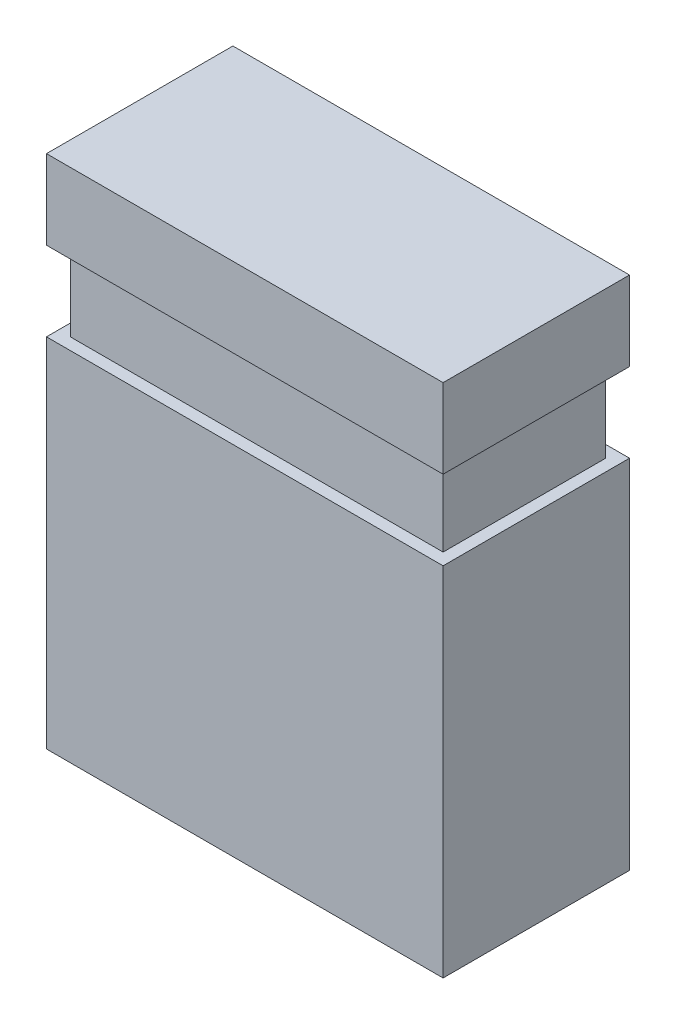
ISO-10303-21;
HEADER;
FILE_DESCRIPTION(('STEP AP214'),'2;1');
FILE_NAME('part.step','',(''),(''),'','','');
FILE_SCHEMA(('AUTOMOTIVE_DESIGN { 1 0 10303 214 1 1 1 1 }'));
ENDSEC;
DATA;
#1=APPLICATION_CONTEXT('core data for automotive mechanical design processes');
#2=APPLICATION_PROTOCOL_DEFINITION('international standard','automotive_design',2000,#1);
#3=PRODUCT_CONTEXT('',#1,'mechanical');
#4=PRODUCT('Part','Part','',(#3));
#5=PRODUCT_RELATED_PRODUCT_CATEGORY('part','',(#4));
#6=PRODUCT_DEFINITION_FORMATION('','',#4);
#7=PRODUCT_DEFINITION_CONTEXT('part definition',#1,'design');
#8=PRODUCT_DEFINITION('design','',#6,#7);
#9=PRODUCT_DEFINITION_SHAPE('','',#8);
#10=(LENGTH_UNIT() NAMED_UNIT(*) SI_UNIT(.MILLI.,.METRE.));
#11=(NAMED_UNIT(*) PLANE_ANGLE_UNIT() SI_UNIT($,.RADIAN.));
#12=(NAMED_UNIT(*) SI_UNIT($,.STERADIAN.) SOLID_ANGLE_UNIT());
#13=UNCERTAINTY_MEASURE_WITH_UNIT(LENGTH_MEASURE(1.E-05),#10,'distance_accuracy_value','');
#14=(GEOMETRIC_REPRESENTATION_CONTEXT(3) GLOBAL_UNCERTAINTY_ASSIGNED_CONTEXT((#13)) GLOBAL_UNIT_ASSIGNED_CONTEXT((#10,
#11,#12)) REPRESENTATION_CONTEXT('',''));
#15=CARTESIAN_POINT('',(0.,0.,0.));
#16=DIRECTION('',(0.,0.,1.));
#17=DIRECTION('',(1.,0.,0.));
#18=AXIS2_PLACEMENT_3D('',#15,#16,#17);
#19=CARTESIAN_POINT('',(-2.5,3.25,-1.175));
#20=DIRECTION('',(-1.,0.,0.));
#21=DIRECTION('',(0.,0.,1.));
#22=AXIS2_PLACEMENT_3D('',#19,#20,#21);
#23=PLANE('',#22);
#24=DIRECTION('',(0.,-1.,0.));
#25=VECTOR('',#24,1.);
#26=CARTESIAN_POINT('',(-2.5,3.25,1.175));
#27=LINE('',#26,#25);
#28=CARTESIAN_POINT('',(-2.5,1.25,1.175));
#29=VERTEX_POINT('',#28);
#30=CARTESIAN_POINT('',(-2.5,-3.25,1.175));
#31=VERTEX_POINT('',#30);
#32=EDGE_CURVE('E231',#29,#31,#27,.T.);
#33=ORIENTED_EDGE('',*,*,#32,.F.);
#34=DIRECTION('',(0.,0.,-1.));
#35=VECTOR('',#34,1.);
#36=CARTESIAN_POINT('',(-2.5,1.25,-1.175));
#37=LINE('',#36,#35);
#38=CARTESIAN_POINT('',(-2.5,1.25,-1.175));
#39=VERTEX_POINT('',#38);
#40=EDGE_CURVE('E226',#29,#39,#37,.T.);
#41=ORIENTED_EDGE('',*,*,#40,.T.);
#42=DIRECTION('',(0.,-1.,0.));
#43=VECTOR('',#42,1.);
#44=CARTESIAN_POINT('',(-2.5,3.25,-1.175));
#45=LINE('',#44,#43);
#46=CARTESIAN_POINT('',(-2.5,-3.25,-1.175));
#47=VERTEX_POINT('',#46);
#48=EDGE_CURVE('E245',#39,#47,#45,.T.);
#49=ORIENTED_EDGE('',*,*,#48,.T.);
#50=DIRECTION('',(0.,0.,1.));
#51=VECTOR('',#50,1.);
#52=CARTESIAN_POINT('',(-2.5,-3.25,-1.175));
#53=LINE('',#52,#51);
#54=EDGE_CURVE('E259',#47,#31,#53,.T.);
#55=ORIENTED_EDGE('',*,*,#54,.T.);
#56=EDGE_LOOP('',(#33,#41,#49,#55));
#57=FACE_BOUND('',#56,.T.);
#58=ADVANCED_FACE('F34',(#57),#23,.T.);
#59=CARTESIAN_POINT('',(2.5,3.25,-1.175));
#60=DIRECTION('',(1.,0.,0.));
#61=DIRECTION('',(0.,0.,-1.));
#62=AXIS2_PLACEMENT_3D('',#59,#60,#61);
#63=PLANE('',#62);
#64=DIRECTION('',(0.,1.,0.));
#65=VECTOR('',#64,1.);
#66=CARTESIAN_POINT('',(2.5,3.25,-1.175));
#67=LINE('',#66,#65);
#68=CARTESIAN_POINT('',(2.5,-3.25,-1.175));
#69=VERTEX_POINT('',#68);
#70=CARTESIAN_POINT('',(2.5,1.25,-1.175));
#71=VERTEX_POINT('',#70);
#72=EDGE_CURVE('E253',#69,#71,#67,.T.);
#73=ORIENTED_EDGE('',*,*,#72,.T.);
#74=DIRECTION('',(0.,0.,1.));
#75=VECTOR('',#74,1.);
#76=CARTESIAN_POINT('',(2.5,1.25,-1.175));
#77=LINE('',#76,#75);
#78=CARTESIAN_POINT('',(2.5,1.25,1.175));
#79=VERTEX_POINT('',#78);
#80=EDGE_CURVE('E223',#71,#79,#77,.T.);
#81=ORIENTED_EDGE('',*,*,#80,.T.);
#82=DIRECTION('',(0.,1.,0.));
#83=VECTOR('',#82,1.);
#84=CARTESIAN_POINT('',(2.5,3.25,1.175));
#85=LINE('',#84,#83);
#86=CARTESIAN_POINT('',(2.5,-3.25,1.175));
#87=VERTEX_POINT('',#86);
#88=EDGE_CURVE('E239',#87,#79,#85,.T.);
#89=ORIENTED_EDGE('',*,*,#88,.F.);
#90=DIRECTION('',(0.,0.,1.));
#91=VECTOR('',#90,1.);
#92=CARTESIAN_POINT('',(2.5,-3.25,-1.175));
#93=LINE('',#92,#91);
#94=EDGE_CURVE('E265',#69,#87,#93,.T.);
#95=ORIENTED_EDGE('',*,*,#94,.F.);
#96=EDGE_LOOP('',(#73,#81,#89,#95));
#97=FACE_BOUND('',#96,.T.);
#98=ADVANCED_FACE('F288',(#97),#63,.T.);
#99=CARTESIAN_POINT('',(-2.5,-3.25,-1.175));
#100=DIRECTION('',(0.,0.,1.));
#101=DIRECTION('',(1.,0.,0.));
#102=AXIS2_PLACEMENT_3D('',#99,#100,#101);
#103=PLANE('',#102);
#104=DIRECTION('',(-1.,0.,0.));
#105=VECTOR('',#104,1.);
#106=CARTESIAN_POINT('',(-2.5,1.25,-1.175));
#107=LINE('',#106,#105);
#108=EDGE_CURVE('E229',#71,#39,#107,.T.);
#109=ORIENTED_EDGE('',*,*,#108,.F.);
#110=ORIENTED_EDGE('',*,*,#72,.F.);
#111=DIRECTION('',(1.,0.,0.));
#112=VECTOR('',#111,1.);
#113=CARTESIAN_POINT('',(-2.5,-3.25,-1.175));
#114=LINE('',#113,#112);
#115=EDGE_CURVE('E249',#47,#69,#114,.T.);
#116=ORIENTED_EDGE('',*,*,#115,.F.);
#117=ORIENTED_EDGE('',*,*,#48,.F.);
#118=EDGE_LOOP('',(#109,#110,#116,#117));
#119=FACE_BOUND('',#118,.T.);
#120=ADVANCED_FACE('F294',(#119),#103,.F.);
#121=CARTESIAN_POINT('',(-2.5,-3.25,1.175));
#122=DIRECTION('',(0.,0.,1.));
#123=DIRECTION('',(1.,0.,0.));
#124=AXIS2_PLACEMENT_3D('',#121,#122,#123);
#125=PLANE('',#124);
#126=ORIENTED_EDGE('',*,*,#88,.T.);
#127=DIRECTION('',(-1.,0.,0.));
#128=VECTOR('',#127,1.);
#129=CARTESIAN_POINT('',(-2.5,1.25,1.175));
#130=LINE('',#129,#128);
#131=EDGE_CURVE('E12',#79,#29,#130,.T.);
#132=ORIENTED_EDGE('',*,*,#131,.T.);
#133=ORIENTED_EDGE('',*,*,#32,.T.);
#134=DIRECTION('',(1.,0.,0.));
#135=VECTOR('',#134,1.);
#136=CARTESIAN_POINT('',(-2.5,-3.25,1.175));
#137=LINE('',#136,#135);
#138=EDGE_CURVE('E235',#31,#87,#137,.T.);
#139=ORIENTED_EDGE('',*,*,#138,.T.);
#140=EDGE_LOOP('',(#126,#132,#133,#139));
#141=FACE_BOUND('',#140,.T.);
#142=ADVANCED_FACE('F307',(#141),#125,.T.);
#143=CARTESIAN_POINT('',(-2.5,-3.25,-1.175));
#144=DIRECTION('',(0.,-1.,0.));
#145=DIRECTION('',(0.,0.,-1.));
#146=AXIS2_PLACEMENT_3D('',#143,#144,#145);
#147=PLANE('',#146);
#148=DIRECTION('',(0.,0.,-1.));
#149=VECTOR('',#148,1.);
#150=CARTESIAN_POINT('',(-2.,-3.25,0.675));
#151=LINE('',#150,#149);
#152=CARTESIAN_POINT('',(-2.,-3.25,0.675));
#153=VERTEX_POINT('',#152);
#154=CARTESIAN_POINT('',(-2.,-3.25,-0.675));
#155=VERTEX_POINT('',#154);
#156=EDGE_CURVE('E49',#153,#155,#151,.T.);
#157=ORIENTED_EDGE('',*,*,#156,.F.);
#158=DIRECTION('',(-1.,0.,0.));
#159=VECTOR('',#158,1.);
#160=CARTESIAN_POINT('',(-2.,-3.25,0.675));
#161=LINE('',#160,#159);
#162=CARTESIAN_POINT('',(2.,-3.25,0.675));
#163=VERTEX_POINT('',#162);
#164=EDGE_CURVE('E167',#163,#153,#161,.T.);
#165=ORIENTED_EDGE('',*,*,#164,.F.);
#166=DIRECTION('',(0.,0.,1.));
#167=VECTOR('',#166,1.);
#168=CARTESIAN_POINT('',(2.,-3.25,0.675));
#169=LINE('',#168,#167);
#170=CARTESIAN_POINT('',(2.,-3.25,-0.675));
#171=VERTEX_POINT('',#170);
#172=EDGE_CURVE('E170',#171,#163,#169,.T.);
#173=ORIENTED_EDGE('',*,*,#172,.F.);
#174=DIRECTION('',(1.,0.,0.));
#175=VECTOR('',#174,1.);
#176=CARTESIAN_POINT('',(-2.,-3.25,-0.675));
#177=LINE('',#176,#175);
#178=EDGE_CURVE('E176',#155,#171,#177,.T.);
#179=ORIENTED_EDGE('',*,*,#178,.F.);
#180=EDGE_LOOP('',(#157,#165,#173,#179));
#181=FACE_BOUND('',#180,.T.);
#182=ORIENTED_EDGE('',*,*,#94,.T.);
#183=ORIENTED_EDGE('',*,*,#138,.F.);
#184=ORIENTED_EDGE('',*,*,#54,.F.);
#185=ORIENTED_EDGE('',*,*,#115,.T.);
#186=EDGE_LOOP('',(#182,#183,#184,#185));
#187=FACE_BOUND('',#186,.T.);
#188=ADVANCED_FACE('F316',(#181,#187),#147,.T.);
#189=CARTESIAN_POINT('',(0.,1.25,0.));
#190=DIRECTION('',(0.,1.,0.));
#191=DIRECTION('',(0.,0.,1.));
#192=AXIS2_PLACEMENT_3D('',#189,#190,#191);
#193=PLANE('',#192);
#194=DIRECTION('',(-1.,0.,0.));
#195=VECTOR('',#194,1.);
#196=CARTESIAN_POINT('',(-2.35,1.25,-1.025));
#197=LINE('',#196,#195);
#198=CARTESIAN_POINT('',(2.35,1.25,-1.025));
#199=VERTEX_POINT('',#198);
#200=CARTESIAN_POINT('',(-2.35,1.25,-1.025));
#201=VERTEX_POINT('',#200);
#202=EDGE_CURVE('E196',#199,#201,#197,.T.);
#203=ORIENTED_EDGE('',*,*,#202,.F.);
#204=DIRECTION('',(0.,0.,-1.));
#205=VECTOR('',#204,1.);
#206=CARTESIAN_POINT('',(2.35,1.25,-1.025));
#207=LINE('',#206,#205);
#208=CARTESIAN_POINT('',(2.35,1.25,1.025));
#209=VERTEX_POINT('',#208);
#210=EDGE_CURVE('E193',#209,#199,#207,.T.);
#211=ORIENTED_EDGE('',*,*,#210,.F.);
#212=DIRECTION('',(1.,0.,0.));
#213=VECTOR('',#212,1.);
#214=CARTESIAN_POINT('',(-2.35,1.25,1.025));
#215=LINE('',#214,#213);
#216=CARTESIAN_POINT('',(-2.35,1.25,1.025));
#217=VERTEX_POINT('',#216);
#218=EDGE_CURVE('E189',#217,#209,#215,.T.);
#219=ORIENTED_EDGE('',*,*,#218,.F.);
#220=DIRECTION('',(0.,0.,1.));
#221=VECTOR('',#220,1.);
#222=CARTESIAN_POINT('',(-2.35,1.25,-1.025));
#223=LINE('',#222,#221);
#224=EDGE_CURVE('E186',#201,#217,#223,.T.);
#225=ORIENTED_EDGE('',*,*,#224,.F.);
#226=EDGE_LOOP('',(#203,#211,#219,#225));
#227=FACE_BOUND('',#226,.T.);
#228=ORIENTED_EDGE('',*,*,#108,.T.);
#229=ORIENTED_EDGE('',*,*,#40,.F.);
#230=ORIENTED_EDGE('',*,*,#131,.F.);
#231=ORIENTED_EDGE('',*,*,#80,.F.);
#232=EDGE_LOOP('',(#228,#229,#230,#231));
#233=FACE_BOUND('',#232,.T.);
#234=ADVANCED_FACE('F310',(#227,#233),#193,.T.);
#235=CARTESIAN_POINT('',(0.,2.25,0.));
#236=DIRECTION('',(0.,1.,0.));
#237=DIRECTION('',(0.,0.,1.));
#238=AXIS2_PLACEMENT_3D('',#235,#236,#237);
#239=PLANE('',#238);
#240=DIRECTION('',(0.,0.,1.));
#241=VECTOR('',#240,1.);
#242=CARTESIAN_POINT('',(-2.35,2.25,-1.025));
#243=LINE('',#242,#241);
#244=CARTESIAN_POINT('',(-2.35,2.25,-1.025));
#245=VERTEX_POINT('',#244);
#246=CARTESIAN_POINT('',(-2.35,2.25,1.025));
#247=VERTEX_POINT('',#246);
#248=EDGE_CURVE('E182',#245,#247,#243,.T.);
#249=ORIENTED_EDGE('',*,*,#248,.T.);
#250=DIRECTION('',(1.,0.,0.));
#251=VECTOR('',#250,1.);
#252=CARTESIAN_POINT('',(-2.35,2.25,1.025));
#253=LINE('',#252,#251);
#254=CARTESIAN_POINT('',(2.35,2.25,1.025));
#255=VERTEX_POINT('',#254);
#256=EDGE_CURVE('E201',#247,#255,#253,.T.);
#257=ORIENTED_EDGE('',*,*,#256,.T.);
#258=DIRECTION('',(0.,0.,-1.));
#259=VECTOR('',#258,1.);
#260=CARTESIAN_POINT('',(2.35,2.25,-1.025));
#261=LINE('',#260,#259);
#262=CARTESIAN_POINT('',(2.35,2.25,-1.025));
#263=VERTEX_POINT('',#262);
#264=EDGE_CURVE('E204',#255,#263,#261,.T.);
#265=ORIENTED_EDGE('',*,*,#264,.T.);
#266=DIRECTION('',(-1.,0.,0.));
#267=VECTOR('',#266,1.);
#268=CARTESIAN_POINT('',(-2.35,2.25,-1.025));
#269=LINE('',#268,#267);
#270=EDGE_CURVE('E190',#263,#245,#269,.T.);
#271=ORIENTED_EDGE('',*,*,#270,.T.);
#272=EDGE_LOOP('',(#249,#257,#265,#271));
#273=FACE_BOUND('',#272,.T.);
#274=DIRECTION('',(0.,0.,1.));
#275=VECTOR('',#274,1.);
#276=CARTESIAN_POINT('',(2.5,2.25,-1.175));
#277=LINE('',#276,#275);
#278=CARTESIAN_POINT('',(2.5,2.25,-1.175));
#279=VERTEX_POINT('',#278);
#280=CARTESIAN_POINT('',(2.5,2.25,1.175));
#281=VERTEX_POINT('',#280);
#282=EDGE_CURVE('E57',#279,#281,#277,.T.);
#283=ORIENTED_EDGE('',*,*,#282,.T.);
#284=DIRECTION('',(-1.,0.,0.));
#285=VECTOR('',#284,1.);
#286=CARTESIAN_POINT('',(-2.5,2.25,1.175));
#287=LINE('',#286,#285);
#288=CARTESIAN_POINT('',(-2.5,2.25,1.175));
#289=VERTEX_POINT('',#288);
#290=EDGE_CURVE('E42',#281,#289,#287,.T.);
#291=ORIENTED_EDGE('',*,*,#290,.T.);
#292=DIRECTION('',(0.,0.,-1.));
#293=VECTOR('',#292,1.);
#294=CARTESIAN_POINT('',(-2.5,2.25,-1.175));
#295=LINE('',#294,#293);
#296=CARTESIAN_POINT('',(-2.5,2.25,-1.175));
#297=VERTEX_POINT('',#296);
#298=EDGE_CURVE('E218',#289,#297,#295,.T.);
#299=ORIENTED_EDGE('',*,*,#298,.T.);
#300=DIRECTION('',(-1.,0.,0.));
#301=VECTOR('',#300,1.);
#302=CARTESIAN_POINT('',(-2.5,2.25,-1.175));
#303=LINE('',#302,#301);
#304=EDGE_CURVE('E220',#279,#297,#303,.T.);
#305=ORIENTED_EDGE('',*,*,#304,.F.);
#306=EDGE_LOOP('',(#283,#291,#299,#305));
#307=FACE_BOUND('',#306,.T.);
#308=ADVANCED_FACE('F269',(#273,#307),#239,.F.);
#309=CARTESIAN_POINT('',(-2.35,1.25,-1.025));
#310=DIRECTION('',(-1.,0.,0.));
#311=DIRECTION('',(0.,0.,1.));
#312=AXIS2_PLACEMENT_3D('',#309,#310,#311);
#313=PLANE('',#312);
#314=ORIENTED_EDGE('',*,*,#248,.F.);
#315=DIRECTION('',(0.,1.,0.));
#316=VECTOR('',#315,1.);
#317=CARTESIAN_POINT('',(-2.35,1.25,-1.025));
#318=LINE('',#317,#316);
#319=EDGE_CURVE('E209',#201,#245,#318,.T.);
#320=ORIENTED_EDGE('',*,*,#319,.F.);
#321=ORIENTED_EDGE('',*,*,#224,.T.);
#322=DIRECTION('',(0.,1.,0.));
#323=VECTOR('',#322,1.);
#324=CARTESIAN_POINT('',(-2.35,1.25,1.025));
#325=LINE('',#324,#323);
#326=EDGE_CURVE('E199',#217,#247,#325,.T.);
#327=ORIENTED_EDGE('',*,*,#326,.T.);
#328=EDGE_LOOP('',(#314,#320,#321,#327));
#329=FACE_BOUND('',#328,.T.);
#330=ADVANCED_FACE('F348',(#329),#313,.T.);
#331=CARTESIAN_POINT('',(-2.35,1.25,-1.025));
#332=DIRECTION('',(0.,0.,-1.));
#333=DIRECTION('',(-1.,0.,0.));
#334=AXIS2_PLACEMENT_3D('',#331,#332,#333);
#335=PLANE('',#334);
#336=ORIENTED_EDGE('',*,*,#270,.F.);
#337=DIRECTION('',(0.,1.,0.));
#338=VECTOR('',#337,1.);
#339=CARTESIAN_POINT('',(2.35,1.25,-1.025));
#340=LINE('',#339,#338);
#341=EDGE_CURVE('E211',#199,#263,#340,.T.);
#342=ORIENTED_EDGE('',*,*,#341,.F.);
#343=ORIENTED_EDGE('',*,*,#202,.T.);
#344=ORIENTED_EDGE('',*,*,#319,.T.);
#345=EDGE_LOOP('',(#336,#342,#343,#344));
#346=FACE_BOUND('',#345,.T.);
#347=ADVANCED_FACE('F344',(#346),#335,.T.);
#348=CARTESIAN_POINT('',(2.35,1.25,-1.025));
#349=DIRECTION('',(1.,0.,0.));
#350=DIRECTION('',(0.,0.,-1.));
#351=AXIS2_PLACEMENT_3D('',#348,#349,#350);
#352=PLANE('',#351);
#353=ORIENTED_EDGE('',*,*,#264,.F.);
#354=DIRECTION('',(0.,1.,0.));
#355=VECTOR('',#354,1.);
#356=CARTESIAN_POINT('',(2.35,1.25,1.025));
#357=LINE('',#356,#355);
#358=EDGE_CURVE('E213',#209,#255,#357,.T.);
#359=ORIENTED_EDGE('',*,*,#358,.F.);
#360=ORIENTED_EDGE('',*,*,#210,.T.);
#361=ORIENTED_EDGE('',*,*,#341,.T.);
#362=EDGE_LOOP('',(#353,#359,#360,#361));
#363=FACE_BOUND('',#362,.T.);
#364=ADVANCED_FACE('F347',(#363),#352,.T.);
#365=CARTESIAN_POINT('',(-2.35,1.25,1.025));
#366=DIRECTION('',(0.,0.,1.));
#367=DIRECTION('',(1.,0.,0.));
#368=AXIS2_PLACEMENT_3D('',#365,#366,#367);
#369=PLANE('',#368);
#370=ORIENTED_EDGE('',*,*,#256,.F.);
#371=ORIENTED_EDGE('',*,*,#326,.F.);
#372=ORIENTED_EDGE('',*,*,#218,.T.);
#373=ORIENTED_EDGE('',*,*,#358,.T.);
#374=EDGE_LOOP('',(#370,#371,#372,#373));
#375=FACE_BOUND('',#374,.T.);
#376=ADVANCED_FACE('F352',(#375),#369,.T.);
#377=CARTESIAN_POINT('',(-2.5,3.25,-1.175));
#378=DIRECTION('',(0.,1.,0.));
#379=DIRECTION('',(0.,0.,1.));
#380=AXIS2_PLACEMENT_3D('',#377,#378,#379);
#381=PLANE('',#380);
#382=DIRECTION('',(0.,0.,1.));
#383=VECTOR('',#382,1.);
#384=CARTESIAN_POINT('',(-2.5,3.25,-1.175));
#385=LINE('',#384,#383);
#386=CARTESIAN_POINT('',(-2.5,3.25,-1.175));
#387=VERTEX_POINT('',#386);
#388=CARTESIAN_POINT('',(-2.5,3.25,1.175));
#389=VERTEX_POINT('',#388);
#390=EDGE_CURVE('E260',#387,#389,#385,.T.);
#391=ORIENTED_EDGE('',*,*,#390,.T.);
#392=DIRECTION('',(-1.,0.,0.));
#393=VECTOR('',#392,1.);
#394=CARTESIAN_POINT('',(-2.5,3.25,1.175));
#395=LINE('',#394,#393);
#396=CARTESIAN_POINT('',(2.5,3.25,1.175));
#397=VERTEX_POINT('',#396);
#398=EDGE_CURVE('E242',#397,#389,#395,.T.);
#399=ORIENTED_EDGE('',*,*,#398,.F.);
#400=DIRECTION('',(0.,0.,1.));
#401=VECTOR('',#400,1.);
#402=CARTESIAN_POINT('',(2.5,3.25,-1.175));
#403=LINE('',#402,#401);
#404=CARTESIAN_POINT('',(2.5,3.25,-1.175));
#405=VERTEX_POINT('',#404);
#406=EDGE_CURVE('E262',#405,#397,#403,.T.);
#407=ORIENTED_EDGE('',*,*,#406,.F.);
#408=DIRECTION('',(-1.,0.,0.));
#409=VECTOR('',#408,1.);
#410=CARTESIAN_POINT('',(-2.5,3.25,-1.175));
#411=LINE('',#410,#409);
#412=EDGE_CURVE('E256',#405,#387,#411,.T.);
#413=ORIENTED_EDGE('',*,*,#412,.T.);
#414=EDGE_LOOP('',(#391,#399,#407,#413));
#415=FACE_BOUND('',#414,.T.);
#416=ADVANCED_FACE('F279',(#415),#381,.T.);
#417=ORIENTED_EDGE('',*,*,#290,.F.);
#418=EDGE_CURVE('E238',#281,#397,#85,.T.);
#419=ORIENTED_EDGE('',*,*,#418,.T.);
#420=ORIENTED_EDGE('',*,*,#398,.T.);
#421=EDGE_CURVE('E232',#389,#289,#27,.T.);
#422=ORIENTED_EDGE('',*,*,#421,.T.);
#423=EDGE_LOOP('',(#417,#419,#420,#422));
#424=FACE_BOUND('',#423,.T.);
#425=ADVANCED_FACE('F275',(#424),#125,.T.);
#426=EDGE_CURVE('E252',#279,#405,#67,.T.);
#427=ORIENTED_EDGE('',*,*,#426,.F.);
#428=ORIENTED_EDGE('',*,*,#304,.T.);
#429=EDGE_CURVE('E246',#387,#297,#45,.T.);
#430=ORIENTED_EDGE('',*,*,#429,.F.);
#431=ORIENTED_EDGE('',*,*,#412,.F.);
#432=EDGE_LOOP('',(#427,#428,#430,#431));
#433=FACE_BOUND('',#432,.T.);
#434=ADVANCED_FACE('F283',(#433),#103,.F.);
#435=ORIENTED_EDGE('',*,*,#282,.F.);
#436=ORIENTED_EDGE('',*,*,#426,.T.);
#437=ORIENTED_EDGE('',*,*,#406,.T.);
#438=ORIENTED_EDGE('',*,*,#418,.F.);
#439=EDGE_LOOP('',(#435,#436,#437,#438));
#440=FACE_BOUND('',#439,.T.);
#441=ADVANCED_FACE('F285',(#440),#63,.T.);
#442=ORIENTED_EDGE('',*,*,#298,.F.);
#443=ORIENTED_EDGE('',*,*,#421,.F.);
#444=ORIENTED_EDGE('',*,*,#390,.F.);
#445=ORIENTED_EDGE('',*,*,#429,.T.);
#446=EDGE_LOOP('',(#442,#443,#444,#445));
#447=FACE_BOUND('',#446,.T.);
#448=ADVANCED_FACE('F36',(#447),#23,.T.);
#449=CARTESIAN_POINT('',(-2.,0.750000000000001,0.675));
#450=DIRECTION('',(-1.,0.,0.));
#451=DIRECTION('',(0.,0.,1.));
#452=AXIS2_PLACEMENT_3D('',#449,#450,#451);
#453=PLANE('',#452);
#454=ORIENTED_EDGE('',*,*,#156,.T.);
#455=DIRECTION('',(0.,-1.,0.));
#456=VECTOR('',#455,1.);
#457=CARTESIAN_POINT('',(-2.,0.750000000000001,-0.675));
#458=LINE('',#457,#456);
#459=CARTESIAN_POINT('',(-2.,0.750000000000001,-0.675));
#460=VERTEX_POINT('',#459);
#461=EDGE_CURVE('E145',#460,#155,#458,.T.);
#462=ORIENTED_EDGE('',*,*,#461,.F.);
#463=DIRECTION('',(0.,0.,-1.));
#464=VECTOR('',#463,1.);
#465=CARTESIAN_POINT('',(-2.,0.750000000000001,0.675));
#466=LINE('',#465,#464);
#467=CARTESIAN_POINT('',(-2.,0.750000000000001,0.675));
#468=VERTEX_POINT('',#467);
#469=EDGE_CURVE('E149',#468,#460,#466,.T.);
#470=ORIENTED_EDGE('',*,*,#469,.F.);
#471=DIRECTION('',(0.,-1.,0.));
#472=VECTOR('',#471,1.);
#473=CARTESIAN_POINT('',(-2.,0.750000000000001,0.675));
#474=LINE('',#473,#472);
#475=EDGE_CURVE('E180',#468,#153,#474,.T.);
#476=ORIENTED_EDGE('',*,*,#475,.T.);
#477=EDGE_LOOP('',(#454,#462,#470,#476));
#478=FACE_BOUND('',#477,.T.);
#479=ADVANCED_FACE('F147',(#478),#453,.F.);
#480=CARTESIAN_POINT('',(-2.,0.750000000000001,0.675));
#481=DIRECTION('',(0.,0.,1.));
#482=DIRECTION('',(1.,0.,0.));
#483=AXIS2_PLACEMENT_3D('',#480,#481,#482);
#484=PLANE('',#483);
#485=ORIENTED_EDGE('',*,*,#164,.T.);
#486=ORIENTED_EDGE('',*,*,#475,.F.);
#487=DIRECTION('',(-1.,0.,0.));
#488=VECTOR('',#487,1.);
#489=CARTESIAN_POINT('',(-2.,0.750000000000001,0.675));
#490=LINE('',#489,#488);
#491=CARTESIAN_POINT('',(2.,0.750000000000001,0.675));
#492=VERTEX_POINT('',#491);
#493=EDGE_CURVE('E155',#492,#468,#490,.T.);
#494=ORIENTED_EDGE('',*,*,#493,.F.);
#495=DIRECTION('',(0.,-1.,0.));
#496=VECTOR('',#495,1.);
#497=CARTESIAN_POINT('',(2.,0.750000000000001,0.675));
#498=LINE('',#497,#496);
#499=EDGE_CURVE('E183',#492,#163,#498,.T.);
#500=ORIENTED_EDGE('',*,*,#499,.T.);
#501=EDGE_LOOP('',(#485,#486,#494,#500));
#502=FACE_BOUND('',#501,.T.);
#503=ADVANCED_FACE('F331',(#502),#484,.F.);
#504=CARTESIAN_POINT('',(2.,0.750000000000001,0.675));
#505=DIRECTION('',(1.,0.,0.));
#506=DIRECTION('',(0.,0.,-1.));
#507=AXIS2_PLACEMENT_3D('',#504,#505,#506);
#508=PLANE('',#507);
#509=ORIENTED_EDGE('',*,*,#172,.T.);
#510=ORIENTED_EDGE('',*,*,#499,.F.);
#511=DIRECTION('',(0.,0.,1.));
#512=VECTOR('',#511,1.);
#513=CARTESIAN_POINT('',(2.,0.750000000000001,0.675));
#514=LINE('',#513,#512);
#515=CARTESIAN_POINT('',(2.,0.750000000000001,-0.675));
#516=VERTEX_POINT('',#515);
#517=EDGE_CURVE('E163',#516,#492,#514,.T.);
#518=ORIENTED_EDGE('',*,*,#517,.F.);
#519=DIRECTION('',(0.,-1.,0.));
#520=VECTOR('',#519,1.);
#521=CARTESIAN_POINT('',(2.,0.750000000000001,-0.675));
#522=LINE('',#521,#520);
#523=EDGE_CURVE('E154',#516,#171,#522,.T.);
#524=ORIENTED_EDGE('',*,*,#523,.T.);
#525=EDGE_LOOP('',(#509,#510,#518,#524));
#526=FACE_BOUND('',#525,.T.);
#527=ADVANCED_FACE('F329',(#526),#508,.F.);
#528=CARTESIAN_POINT('',(-2.,0.750000000000001,-0.675));
#529=DIRECTION('',(0.,0.,-1.));
#530=DIRECTION('',(-1.,0.,0.));
#531=AXIS2_PLACEMENT_3D('',#528,#529,#530);
#532=PLANE('',#531);
#533=ORIENTED_EDGE('',*,*,#178,.T.);
#534=ORIENTED_EDGE('',*,*,#523,.F.);
#535=DIRECTION('',(1.,0.,0.));
#536=VECTOR('',#535,1.);
#537=CARTESIAN_POINT('',(-2.,0.750000000000001,-0.675));
#538=LINE('',#537,#536);
#539=EDGE_CURVE('E158',#460,#516,#538,.T.);
#540=ORIENTED_EDGE('',*,*,#539,.F.);
#541=ORIENTED_EDGE('',*,*,#461,.T.);
#542=EDGE_LOOP('',(#533,#534,#540,#541));
#543=FACE_BOUND('',#542,.T.);
#544=ADVANCED_FACE('F159',(#543),#532,.F.);
#545=CARTESIAN_POINT('',(-2.,0.750000000000001,-0.675));
#546=DIRECTION('',(0.,-1.,0.));
#547=DIRECTION('',(0.,0.,-1.));
#548=AXIS2_PLACEMENT_3D('',#545,#546,#547);
#549=PLANE('',#548);
#550=ORIENTED_EDGE('',*,*,#469,.T.);
#551=ORIENTED_EDGE('',*,*,#539,.T.);
#552=ORIENTED_EDGE('',*,*,#517,.T.);
#553=ORIENTED_EDGE('',*,*,#493,.T.);
#554=EDGE_LOOP('',(#550,#551,#552,#553));
#555=FACE_BOUND('',#554,.T.);
#556=ADVANCED_FACE('F165',(#555),#549,.T.);
#557=CLOSED_SHELL('',(#58,#98,#120,#142,#188,#234,#308,#330,#347,#364,#376,#416,#425,#434,#441,
#448,#479,#503,#527,#544,#556));
#558=MANIFOLD_SOLID_BREP('B2',#557);
#559=ADVANCED_BREP_SHAPE_REPRESENTATION('',(#18,#558),#14);
#560=SHAPE_DEFINITION_REPRESENTATION(#9,#559);
ENDSEC;
END-ISO-10303-21;
